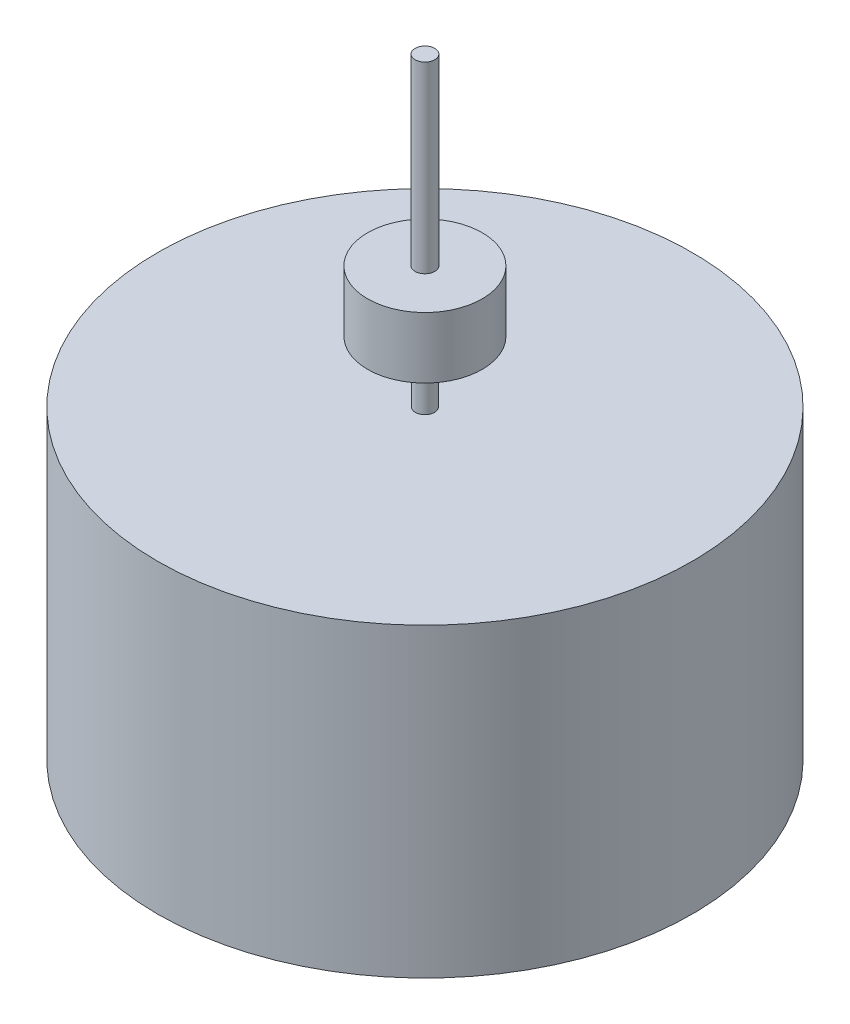
ISO-10303-21;
HEADER;
FILE_DESCRIPTION(('STEP AP214'),'2;1');
FILE_NAME('part.step','',(''),(''),'','','');
FILE_SCHEMA(('AUTOMOTIVE_DESIGN { 1 0 10303 214 1 1 1 1 }'));
ENDSEC;
DATA;
#1=APPLICATION_CONTEXT('core data for automotive mechanical design processes');
#2=APPLICATION_PROTOCOL_DEFINITION('international standard','automotive_design',2000,#1);
#3=PRODUCT_CONTEXT('',#1,'mechanical');
#4=PRODUCT('Part','Part','',(#3));
#5=PRODUCT_RELATED_PRODUCT_CATEGORY('part','',(#4));
#6=PRODUCT_DEFINITION_FORMATION('','',#4);
#7=PRODUCT_DEFINITION_CONTEXT('part definition',#1,'design');
#8=PRODUCT_DEFINITION('design','',#6,#7);
#9=PRODUCT_DEFINITION_SHAPE('','',#8);
#10=(LENGTH_UNIT() NAMED_UNIT(*) SI_UNIT(.MILLI.,.METRE.));
#11=(NAMED_UNIT(*) PLANE_ANGLE_UNIT() SI_UNIT($,.RADIAN.));
#12=(NAMED_UNIT(*) SI_UNIT($,.STERADIAN.) SOLID_ANGLE_UNIT());
#13=UNCERTAINTY_MEASURE_WITH_UNIT(LENGTH_MEASURE(1.E-05),#10,'distance_accuracy_value','');
#14=(GEOMETRIC_REPRESENTATION_CONTEXT(3) GLOBAL_UNCERTAINTY_ASSIGNED_CONTEXT((#13)) GLOBAL_UNIT_ASSIGNED_CONTEXT((#10,
#11,#12)) REPRESENTATION_CONTEXT('',''));
#15=CARTESIAN_POINT('',(0.,0.,0.));
#16=DIRECTION('',(0.,0.,1.));
#17=DIRECTION('',(1.,0.,0.));
#18=AXIS2_PLACEMENT_3D('',#15,#16,#17);
#19=CARTESIAN_POINT('',(0.,17.78,0.));
#20=DIRECTION('',(0.,1.,0.));
#21=DIRECTION('',(0.,0.,1.));
#22=AXIS2_PLACEMENT_3D('',#19,#20,#21);
#23=PLANE('',#22);
#24=CARTESIAN_POINT('',(0.,17.78,0.));
#25=DIRECTION('',(0.,1.,0.));
#26=DIRECTION('',(0.,0.,1.));
#27=AXIS2_PLACEMENT_3D('',#24,#25,#26);
#28=CIRCLE('',#27,2.38125);
#29=CARTESIAN_POINT('',(0.,17.78,2.38125));
#30=VERTEX_POINT('',#29);
#31=EDGE_CURVE('E55',#30,#30,#28,.T.);
#32=ORIENTED_EDGE('',*,*,#31,.T.);
#33=EDGE_LOOP('',(#32));
#34=FACE_BOUND('',#33,.T.);
#35=CARTESIAN_POINT('',(0.,17.78,0.));
#36=DIRECTION('',(0.,1.,0.));
#37=DIRECTION('',(0.,0.,1.));
#38=AXIS2_PLACEMENT_3D('',#35,#36,#37);
#39=CIRCLE('',#38,0.409677419354839);
#40=CARTESIAN_POINT('',(0.,17.78,0.409677419354839));
#41=VERTEX_POINT('',#40);
#42=EDGE_CURVE('E67',#41,#41,#39,.T.);
#43=ORIENTED_EDGE('',*,*,#42,.F.);
#44=EDGE_LOOP('',(#43));
#45=FACE_BOUND('',#44,.T.);
#46=ADVANCED_FACE('F35',(#34,#45),#23,.T.);
#47=CARTESIAN_POINT('',(0.,12.7,0.));
#48=DIRECTION('',(0.,1.,0.));
#49=DIRECTION('',(0.,0.,1.));
#50=AXIS2_PLACEMENT_3D('',#47,#48,#49);
#51=PLANE('',#50);
#52=CARTESIAN_POINT('',(0.,12.7,0.));
#53=DIRECTION('',(0.,1.,0.));
#54=DIRECTION('',(0.,0.,1.));
#55=AXIS2_PLACEMENT_3D('',#52,#53,#54);
#56=CIRCLE('',#55,11.1125);
#57=CARTESIAN_POINT('',(0.,12.7,11.1125));
#58=VERTEX_POINT('',#57);
#59=EDGE_CURVE('E10',#58,#58,#56,.T.);
#60=ORIENTED_EDGE('',*,*,#59,.T.);
#61=EDGE_LOOP('',(#60));
#62=FACE_BOUND('',#61,.T.);
#63=CARTESIAN_POINT('',(0.,12.7,0.));
#64=DIRECTION('',(0.,1.,0.));
#65=DIRECTION('',(0.,0.,1.));
#66=AXIS2_PLACEMENT_3D('',#63,#64,#65);
#67=CIRCLE('',#66,0.396875);
#68=CARTESIAN_POINT('',(0.,12.7,0.396875));
#69=VERTEX_POINT('',#68);
#70=EDGE_CURVE('E51',#69,#69,#67,.T.);
#71=ORIENTED_EDGE('',*,*,#70,.F.);
#72=EDGE_LOOP('',(#71));
#73=FACE_BOUND('',#72,.T.);
#74=ADVANCED_FACE('F84',(#62,#73),#51,.T.);
#75=CARTESIAN_POINT('',(0.,12.7,0.));
#76=DIRECTION('',(0.,-1.,0.));
#77=DIRECTION('',(0.,0.,-1.));
#78=AXIS2_PLACEMENT_3D('',#75,#76,#77);
#79=CYLINDRICAL_SURFACE('',#78,11.1125);
#80=ORIENTED_EDGE('',*,*,#59,.F.);
#81=EDGE_LOOP('',(#80));
#82=FACE_BOUND('',#81,.T.);
#83=CARTESIAN_POINT('',(0.,0.,0.));
#84=DIRECTION('',(0.,1.,0.));
#85=DIRECTION('',(0.,0.,1.));
#86=AXIS2_PLACEMENT_3D('',#83,#84,#85);
#87=CIRCLE('',#86,11.1125);
#88=CARTESIAN_POINT('',(0.,0.,11.1125));
#89=VERTEX_POINT('',#88);
#90=EDGE_CURVE('E39',#89,#89,#87,.T.);
#91=ORIENTED_EDGE('',*,*,#90,.T.);
#92=EDGE_LOOP('',(#91));
#93=FACE_BOUND('',#92,.T.);
#94=ADVANCED_FACE('F37',(#82,#93),#79,.T.);
#95=CARTESIAN_POINT('',(0.,0.,0.));
#96=DIRECTION('',(0.,1.,0.));
#97=DIRECTION('',(0.,0.,1.));
#98=AXIS2_PLACEMENT_3D('',#95,#96,#97);
#99=PLANE('',#98);
#100=ORIENTED_EDGE('',*,*,#90,.F.);
#101=EDGE_LOOP('',(#100));
#102=FACE_BOUND('',#101,.T.);
#103=ADVANCED_FACE('F102',(#102),#99,.F.);
#104=CARTESIAN_POINT('',(0.,15.24,0.));
#105=DIRECTION('',(0.,-1.,0.));
#106=DIRECTION('',(0.,0.,-1.));
#107=AXIS2_PLACEMENT_3D('',#104,#105,#106);
#108=CYLINDRICAL_SURFACE('',#107,0.396875);
#109=CARTESIAN_POINT('',(0.,15.24,0.));
#110=DIRECTION('',(0.,1.,0.));
#111=DIRECTION('',(0.,0.,1.));
#112=AXIS2_PLACEMENT_3D('',#109,#110,#111);
#113=CIRCLE('',#112,0.396875);
#114=CARTESIAN_POINT('',(0.,15.24,0.396875));
#115=VERTEX_POINT('',#114);
#116=EDGE_CURVE('E49',#115,#115,#113,.T.);
#117=ORIENTED_EDGE('',*,*,#116,.F.);
#118=EDGE_LOOP('',(#117));
#119=FACE_BOUND('',#118,.T.);
#120=ORIENTED_EDGE('',*,*,#70,.T.);
#121=EDGE_LOOP('',(#120));
#122=FACE_BOUND('',#121,.T.);
#123=ADVANCED_FACE('F96',(#119,#122),#108,.T.);
#124=CARTESIAN_POINT('',(0.,15.24,0.));
#125=DIRECTION('',(0.,1.,0.));
#126=DIRECTION('',(0.,0.,1.));
#127=AXIS2_PLACEMENT_3D('',#124,#125,#126);
#128=PLANE('',#127);
#129=CARTESIAN_POINT('',(0.,15.24,0.));
#130=DIRECTION('',(0.,1.,0.));
#131=DIRECTION('',(0.,0.,1.));
#132=AXIS2_PLACEMENT_3D('',#129,#130,#131);
#133=CIRCLE('',#132,2.38125);
#134=CARTESIAN_POINT('',(0.,15.24,2.38125));
#135=VERTEX_POINT('',#134);
#136=EDGE_CURVE('E59',#135,#135,#133,.T.);
#137=ORIENTED_EDGE('',*,*,#136,.F.);
#138=EDGE_LOOP('',(#137));
#139=FACE_BOUND('',#138,.T.);
#140=ORIENTED_EDGE('',*,*,#116,.T.);
#141=EDGE_LOOP('',(#140));
#142=FACE_BOUND('',#141,.T.);
#143=ADVANCED_FACE('F93',(#139,#142),#128,.F.);
#144=CARTESIAN_POINT('',(0.,17.78,0.));
#145=DIRECTION('',(0.,-1.,0.));
#146=DIRECTION('',(0.,0.,-1.));
#147=AXIS2_PLACEMENT_3D('',#144,#145,#146);
#148=CYLINDRICAL_SURFACE('',#147,2.38125);
#149=ORIENTED_EDGE('',*,*,#31,.F.);
#150=EDGE_LOOP('',(#149));
#151=FACE_BOUND('',#150,.T.);
#152=ORIENTED_EDGE('',*,*,#136,.T.);
#153=EDGE_LOOP('',(#152));
#154=FACE_BOUND('',#153,.T.);
#155=ADVANCED_FACE('F79',(#151,#154),#148,.T.);
#156=CARTESIAN_POINT('',(0.,25.4,0.));
#157=DIRECTION('',(0.,-1.,0.));
#158=DIRECTION('',(0.,0.,-1.));
#159=AXIS2_PLACEMENT_3D('',#156,#157,#158);
#160=CYLINDRICAL_SURFACE('',#159,0.409677419354839);
#161=CARTESIAN_POINT('',(0.,25.4,0.));
#162=DIRECTION('',(0.,1.,0.));
#163=DIRECTION('',(0.,0.,1.));
#164=AXIS2_PLACEMENT_3D('',#161,#162,#163);
#165=CIRCLE('',#164,0.409677419354839);
#166=CARTESIAN_POINT('',(0.,25.4,0.409677419354839));
#167=VERTEX_POINT('',#166);
#168=EDGE_CURVE('E63',#167,#167,#165,.T.);
#169=ORIENTED_EDGE('',*,*,#168,.F.);
#170=EDGE_LOOP('',(#169));
#171=FACE_BOUND('',#170,.T.);
#172=ORIENTED_EDGE('',*,*,#42,.T.);
#173=EDGE_LOOP('',(#172));
#174=FACE_BOUND('',#173,.T.);
#175=ADVANCED_FACE('F76',(#171,#174),#160,.T.);
#176=CARTESIAN_POINT('',(0.,25.4,0.));
#177=DIRECTION('',(0.,1.,0.));
#178=DIRECTION('',(0.,0.,1.));
#179=AXIS2_PLACEMENT_3D('',#176,#177,#178);
#180=PLANE('',#179);
#181=ORIENTED_EDGE('',*,*,#168,.T.);
#182=EDGE_LOOP('',(#181));
#183=FACE_BOUND('',#182,.T.);
#184=ADVANCED_FACE('F74',(#183),#180,.T.);
#185=CLOSED_SHELL('',(#46,#74,#94,#103,#123,#143,#155,#175,#184));
#186=MANIFOLD_SOLID_BREP('B2',#185);
#187=ADVANCED_BREP_SHAPE_REPRESENTATION('',(#18,#186),#14);
#188=SHAPE_DEFINITION_REPRESENTATION(#9,#187);
ENDSEC;
END-ISO-10303-21;
